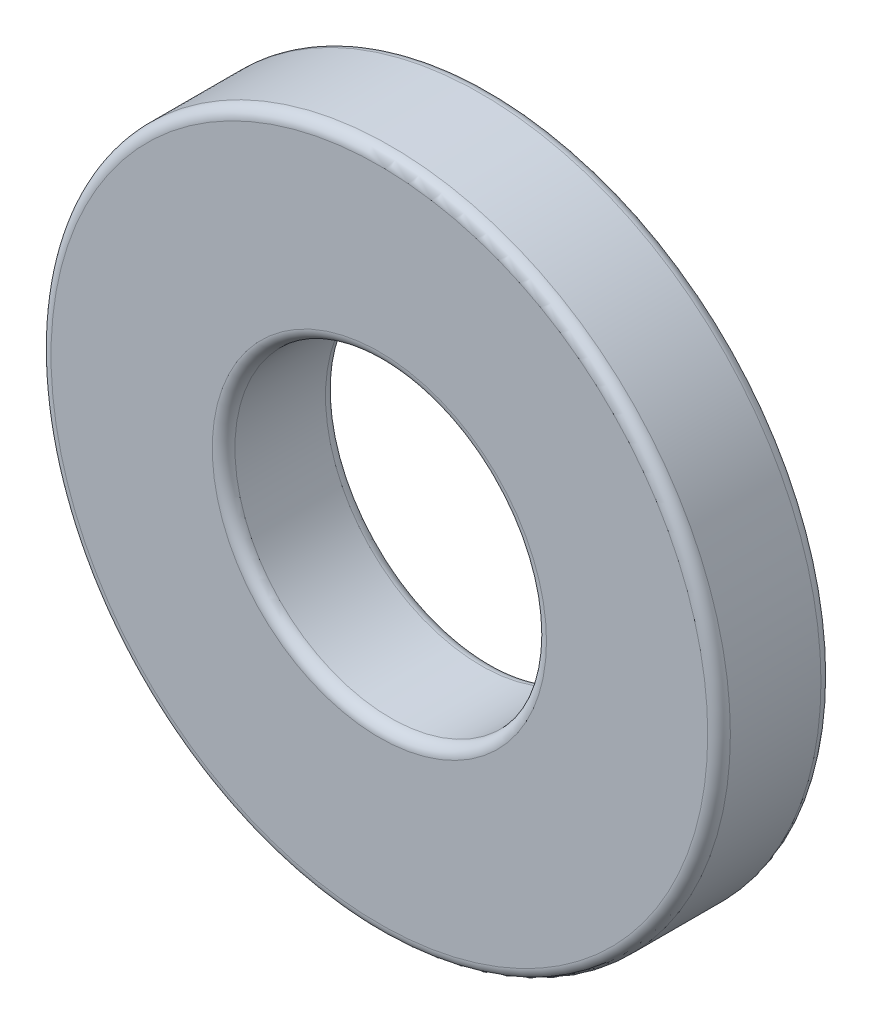
ISO-10303-21;
HEADER;
FILE_DESCRIPTION(('STEP AP214'),'2;1');
FILE_NAME('part.step','',(''),(''),'','','');
FILE_SCHEMA(('AUTOMOTIVE_DESIGN { 1 0 10303 214 1 1 1 1 }'));
ENDSEC;
DATA;
#1=APPLICATION_CONTEXT('core data for automotive mechanical design processes');
#2=APPLICATION_PROTOCOL_DEFINITION('international standard','automotive_design',2000,#1);
#3=PRODUCT_CONTEXT('',#1,'mechanical');
#4=PRODUCT('Part','Part','',(#3));
#5=PRODUCT_RELATED_PRODUCT_CATEGORY('part','',(#4));
#6=PRODUCT_DEFINITION_FORMATION('','',#4);
#7=PRODUCT_DEFINITION_CONTEXT('part definition',#1,'design');
#8=PRODUCT_DEFINITION('design','',#6,#7);
#9=PRODUCT_DEFINITION_SHAPE('','',#8);
#10=(LENGTH_UNIT() NAMED_UNIT(*) SI_UNIT(.MILLI.,.METRE.));
#11=(NAMED_UNIT(*) PLANE_ANGLE_UNIT() SI_UNIT($,.RADIAN.));
#12=(NAMED_UNIT(*) SI_UNIT($,.STERADIAN.) SOLID_ANGLE_UNIT());
#13=UNCERTAINTY_MEASURE_WITH_UNIT(LENGTH_MEASURE(1.E-05),#10,'distance_accuracy_value','');
#14=(GEOMETRIC_REPRESENTATION_CONTEXT(3) GLOBAL_UNCERTAINTY_ASSIGNED_CONTEXT((#13)) GLOBAL_UNIT_ASSIGNED_CONTEXT((#10,
#11,#12)) REPRESENTATION_CONTEXT('',''));
#15=CARTESIAN_POINT('',(0.,0.,0.));
#16=DIRECTION('',(0.,0.,1.));
#17=DIRECTION('',(1.,0.,0.));
#18=AXIS2_PLACEMENT_3D('',#15,#16,#17);
#19=CARTESIAN_POINT('',(0.,0.,-1.5875));
#20=DIRECTION('',(0.,0.,1.));
#21=DIRECTION('',(1.,0.,0.));
#22=AXIS2_PLACEMENT_3D('',#19,#20,#21);
#23=CYLINDRICAL_SURFACE('',#22,9.525);
#24=CARTESIAN_POINT('',(0.,0.,1.27));
#25=DIRECTION('',(0.,0.,1.));
#26=DIRECTION('',(1.,0.,0.));
#27=AXIS2_PLACEMENT_3D('',#24,#25,#26);
#28=CIRCLE('',#27,9.525);
#29=CARTESIAN_POINT('',(9.525,0.,1.27));
#30=VERTEX_POINT('',#29);
#31=EDGE_CURVE('E10',#30,#30,#28,.F.);
#32=ORIENTED_EDGE('',*,*,#31,.T.);
#33=EDGE_LOOP('',(#32));
#34=FACE_BOUND('',#33,.T.);
#35=CARTESIAN_POINT('',(0.,0.,-1.27));
#36=DIRECTION('',(0.,0.,1.));
#37=DIRECTION('',(1.,0.,0.));
#38=AXIS2_PLACEMENT_3D('',#35,#36,#37);
#39=CIRCLE('',#38,9.525);
#40=CARTESIAN_POINT('',(9.525,0.,-1.27));
#41=VERTEX_POINT('',#40);
#42=EDGE_CURVE('E47',#41,#41,#39,.T.);
#43=ORIENTED_EDGE('',*,*,#42,.T.);
#44=EDGE_LOOP('',(#43));
#45=FACE_BOUND('',#44,.T.);
#46=ADVANCED_FACE('F39',(#34,#45),#23,.T.);
#47=CARTESIAN_POINT('',(0.,0.,-1.5875));
#48=DIRECTION('',(0.,0.,1.));
#49=DIRECTION('',(1.,0.,0.));
#50=AXIS2_PLACEMENT_3D('',#47,#48,#49);
#51=PLANE('',#50);
#52=CARTESIAN_POINT('',(0.,0.,-1.5875));
#53=DIRECTION('',(0.,0.,1.));
#54=DIRECTION('',(1.,0.,0.));
#55=AXIS2_PLACEMENT_3D('',#52,#53,#54);
#56=CIRCLE('',#55,4.6863);
#57=CARTESIAN_POINT('',(4.6863,0.,-1.5875));
#58=VERTEX_POINT('',#57);
#59=EDGE_CURVE('E54',#58,#58,#56,.T.);
#60=ORIENTED_EDGE('',*,*,#59,.T.);
#61=EDGE_LOOP('',(#60));
#62=FACE_BOUND('',#61,.T.);
#63=CARTESIAN_POINT('',(0.,0.,-1.5875));
#64=DIRECTION('',(0.,0.,1.));
#65=DIRECTION('',(1.,0.,0.));
#66=AXIS2_PLACEMENT_3D('',#63,#64,#65);
#67=CIRCLE('',#66,9.2075);
#68=CARTESIAN_POINT('',(9.2075,0.,-1.5875));
#69=VERTEX_POINT('',#68);
#70=EDGE_CURVE('E58',#69,#69,#67,.F.);
#71=ORIENTED_EDGE('',*,*,#70,.T.);
#72=EDGE_LOOP('',(#71));
#73=FACE_BOUND('',#72,.T.);
#74=ADVANCED_FACE('F89',(#62,#73),#51,.F.);
#75=CARTESIAN_POINT('',(0.,0.,1.5875));
#76=DIRECTION('',(0.,0.,1.));
#77=DIRECTION('',(1.,0.,0.));
#78=AXIS2_PLACEMENT_3D('',#75,#76,#77);
#79=PLANE('',#78);
#80=CARTESIAN_POINT('',(0.,0.,1.5875));
#81=DIRECTION('',(0.,0.,1.));
#82=DIRECTION('',(1.,0.,0.));
#83=AXIS2_PLACEMENT_3D('',#80,#81,#82);
#84=CIRCLE('',#83,4.6863);
#85=CARTESIAN_POINT('',(4.6863,0.,1.5875));
#86=VERTEX_POINT('',#85);
#87=EDGE_CURVE('E63',#86,#86,#84,.F.);
#88=ORIENTED_EDGE('',*,*,#87,.T.);
#89=EDGE_LOOP('',(#88));
#90=FACE_BOUND('',#89,.T.);
#91=CARTESIAN_POINT('',(0.,0.,1.5875));
#92=DIRECTION('',(0.,0.,1.));
#93=DIRECTION('',(1.,0.,0.));
#94=AXIS2_PLACEMENT_3D('',#91,#92,#93);
#95=CIRCLE('',#94,9.2075);
#96=CARTESIAN_POINT('',(9.2075,0.,1.5875));
#97=VERTEX_POINT('',#96);
#98=EDGE_CURVE('E67',#97,#97,#95,.T.);
#99=ORIENTED_EDGE('',*,*,#98,.T.);
#100=EDGE_LOOP('',(#99));
#101=FACE_BOUND('',#100,.T.);
#102=ADVANCED_FACE('F92',(#90,#101),#79,.T.);
#103=CARTESIAN_POINT('',(0.,0.,-1.5875));
#104=DIRECTION('',(0.,0.,1.));
#105=DIRECTION('',(1.,0.,0.));
#106=AXIS2_PLACEMENT_3D('',#103,#104,#105);
#107=CYLINDRICAL_SURFACE('',#106,4.3688);
#108=CARTESIAN_POINT('',(0.,0.,1.27));
#109=DIRECTION('',(0.,0.,1.));
#110=DIRECTION('',(1.,0.,0.));
#111=AXIS2_PLACEMENT_3D('',#108,#109,#110);
#112=CIRCLE('',#111,4.3688);
#113=CARTESIAN_POINT('',(4.3688,0.,1.27));
#114=VERTEX_POINT('',#113);
#115=EDGE_CURVE('E70',#114,#114,#112,.T.);
#116=ORIENTED_EDGE('',*,*,#115,.T.);
#117=EDGE_LOOP('',(#116));
#118=FACE_BOUND('',#117,.T.);
#119=CARTESIAN_POINT('',(0.,0.,-1.27));
#120=DIRECTION('',(0.,0.,1.));
#121=DIRECTION('',(1.,0.,0.));
#122=AXIS2_PLACEMENT_3D('',#119,#120,#121);
#123=CIRCLE('',#122,4.3688);
#124=CARTESIAN_POINT('',(4.3688,0.,-1.27));
#125=VERTEX_POINT('',#124);
#126=EDGE_CURVE('E74',#125,#125,#123,.F.);
#127=ORIENTED_EDGE('',*,*,#126,.T.);
#128=EDGE_LOOP('',(#127));
#129=FACE_BOUND('',#128,.T.);
#130=ADVANCED_FACE('F79',(#118,#129),#107,.F.);
#131=CARTESIAN_POINT('',(0.,0.,1.27));
#132=DIRECTION('',(0.,0.,1.));
#133=DIRECTION('',(1.,0.,0.));
#134=AXIS2_PLACEMENT_3D('',#131,#132,#133);
#135=TOROIDAL_SURFACE('',#134,4.6863,0.3175);
#136=ORIENTED_EDGE('',*,*,#87,.F.);
#137=EDGE_LOOP('',(#136));
#138=FACE_BOUND('',#137,.T.);
#139=ORIENTED_EDGE('',*,*,#115,.F.);
#140=EDGE_LOOP('',(#139));
#141=FACE_BOUND('',#140,.T.);
#142=ADVANCED_FACE('F85',(#138,#141),#135,.T.);
#143=CARTESIAN_POINT('',(0.,0.,-1.27));
#144=DIRECTION('',(0.,0.,1.));
#145=DIRECTION('',(1.,0.,0.));
#146=AXIS2_PLACEMENT_3D('',#143,#144,#145);
#147=TOROIDAL_SURFACE('',#146,4.6863,0.3175);
#148=ORIENTED_EDGE('',*,*,#126,.F.);
#149=EDGE_LOOP('',(#148));
#150=FACE_BOUND('',#149,.T.);
#151=ORIENTED_EDGE('',*,*,#59,.F.);
#152=EDGE_LOOP('',(#151));
#153=FACE_BOUND('',#152,.T.);
#154=ADVANCED_FACE('F81',(#150,#153),#147,.T.);
#155=CARTESIAN_POINT('',(0.,0.,1.27));
#156=DIRECTION('',(0.,0.,1.));
#157=DIRECTION('',(1.,0.,0.));
#158=AXIS2_PLACEMENT_3D('',#155,#156,#157);
#159=TOROIDAL_SURFACE('',#158,9.2075,0.3175);
#160=ORIENTED_EDGE('',*,*,#31,.F.);
#161=EDGE_LOOP('',(#160));
#162=FACE_BOUND('',#161,.T.);
#163=ORIENTED_EDGE('',*,*,#98,.F.);
#164=EDGE_LOOP('',(#163));
#165=FACE_BOUND('',#164,.T.);
#166=ADVANCED_FACE('F84',(#162,#165),#159,.T.);
#167=CARTESIAN_POINT('',(0.,0.,-1.27));
#168=DIRECTION('',(0.,0.,1.));
#169=DIRECTION('',(1.,0.,0.));
#170=AXIS2_PLACEMENT_3D('',#167,#168,#169);
#171=TOROIDAL_SURFACE('',#170,9.2075,0.3175);
#172=ORIENTED_EDGE('',*,*,#70,.F.);
#173=EDGE_LOOP('',(#172));
#174=FACE_BOUND('',#173,.T.);
#175=ORIENTED_EDGE('',*,*,#42,.F.);
#176=EDGE_LOOP('',(#175));
#177=FACE_BOUND('',#176,.T.);
#178=ADVANCED_FACE('F41',(#174,#177),#171,.T.);
#179=CLOSED_SHELL('',(#46,#74,#102,#130,#142,#154,#166,#178));
#180=MANIFOLD_SOLID_BREP('B2',#179);
#181=ADVANCED_BREP_SHAPE_REPRESENTATION('',(#18,#180),#14);
#182=SHAPE_DEFINITION_REPRESENTATION(#9,#181);
ENDSEC;
END-ISO-10303-21;
